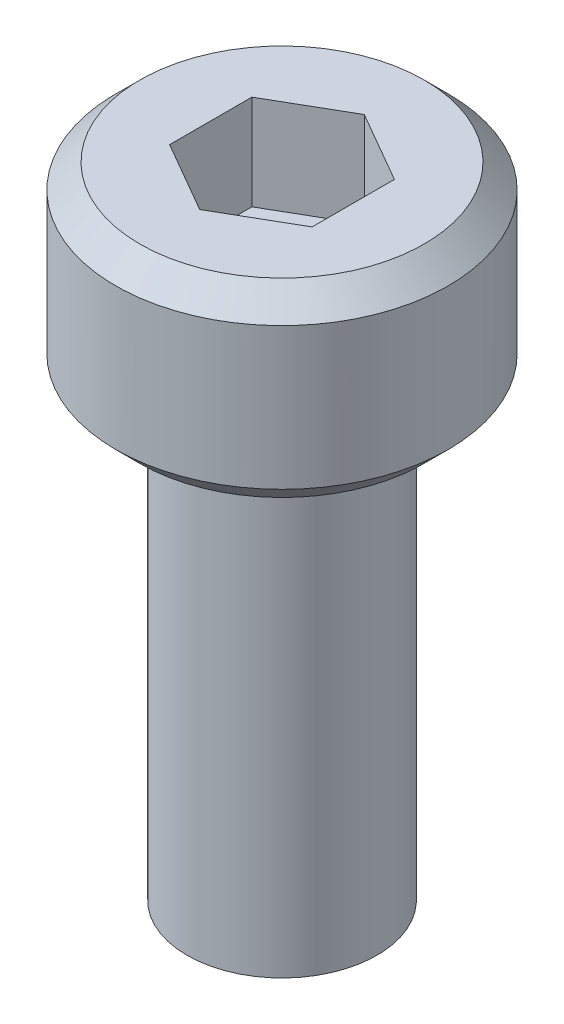
ISO-10303-21;
HEADER;
FILE_DESCRIPTION(('STEP AP214'),'2;1');
FILE_NAME('part.step','',(''),(''),'','','');
FILE_SCHEMA(('AUTOMOTIVE_DESIGN { 1 0 10303 214 1 1 1 1 }'));
ENDSEC;
DATA;
#1=APPLICATION_CONTEXT('core data for automotive mechanical design processes');
#2=APPLICATION_PROTOCOL_DEFINITION('international standard','automotive_design',2000,#1);
#3=PRODUCT_CONTEXT('',#1,'mechanical');
#4=PRODUCT('Part','Part','',(#3));
#5=PRODUCT_RELATED_PRODUCT_CATEGORY('part','',(#4));
#6=PRODUCT_DEFINITION_FORMATION('','',#4);
#7=PRODUCT_DEFINITION_CONTEXT('part definition',#1,'design');
#8=PRODUCT_DEFINITION('design','',#6,#7);
#9=PRODUCT_DEFINITION_SHAPE('','',#8);
#10=(LENGTH_UNIT() NAMED_UNIT(*) SI_UNIT(.MILLI.,.METRE.));
#11=(NAMED_UNIT(*) PLANE_ANGLE_UNIT() SI_UNIT($,.RADIAN.));
#12=(NAMED_UNIT(*) SI_UNIT($,.STERADIAN.) SOLID_ANGLE_UNIT());
#13=UNCERTAINTY_MEASURE_WITH_UNIT(LENGTH_MEASURE(1.E-05),#10,'distance_accuracy_value','');
#14=(GEOMETRIC_REPRESENTATION_CONTEXT(3) GLOBAL_UNCERTAINTY_ASSIGNED_CONTEXT((#13)) GLOBAL_UNIT_ASSIGNED_CONTEXT((#10,
#11,#12)) REPRESENTATION_CONTEXT('',''));
#15=CARTESIAN_POINT('',(0.,0.,0.));
#16=DIRECTION('',(0.,0.,1.));
#17=DIRECTION('',(1.,0.,0.));
#18=AXIS2_PLACEMENT_3D('',#15,#16,#17);
#19=CARTESIAN_POINT('',(0.,1.99999199999999,-1.73205080756887));
#20=DIRECTION('',(-0.5,0.,-0.866025403784439));
#21=DIRECTION('',(-0.866025403784439,0.,0.5));
#22=AXIS2_PLACEMENT_3D('',#19,#20,#21);
#23=PLANE('',#22);
#24=DIRECTION('',(0.,-1.,0.));
#25=VECTOR('',#24,1.);
#26=CARTESIAN_POINT('',(-1.49999999999999,1.99999199999999,-0.866025403784432));
#27=LINE('',#26,#25);
#28=CARTESIAN_POINT('',(-1.49999999999999,3.99999199999999,-0.866025403784429));
#29=VERTEX_POINT('',#28);
#30=CARTESIAN_POINT('',(-1.49999999999999,1.99999199999999,-0.866025403784429));
#31=VERTEX_POINT('',#30);
#32=EDGE_CURVE('E82',#29,#31,#27,.T.);
#33=ORIENTED_EDGE('',*,*,#32,.T.);
#34=DIRECTION('',(-0.866025403784439,0.,0.5));
#35=VECTOR('',#34,1.);
#36=CARTESIAN_POINT('',(0.,1.99999199999999,-1.73205080756887));
#37=LINE('',#36,#35);
#38=CARTESIAN_POINT('',(0.,1.999992,-1.73205080756887));
#39=VERTEX_POINT('',#38);
#40=EDGE_CURVE('E71',#39,#31,#37,.T.);
#41=ORIENTED_EDGE('',*,*,#40,.F.);
#42=DIRECTION('',(0.,1.,0.));
#43=VECTOR('',#42,1.);
#44=CARTESIAN_POINT('',(0.,1.99999200000003,-1.73205080756886));
#45=LINE('',#44,#43);
#46=CARTESIAN_POINT('',(0.,3.99999200000001,-1.73205080756887));
#47=VERTEX_POINT('',#46);
#48=EDGE_CURVE('E91',#39,#47,#45,.T.);
#49=ORIENTED_EDGE('',*,*,#48,.T.);
#50=DIRECTION('',(-0.866025403784439,0.,0.5));
#51=VECTOR('',#50,1.);
#52=CARTESIAN_POINT('',(0.,3.99999199999999,-1.73205080756887));
#53=LINE('',#52,#51);
#54=EDGE_CURVE('E66',#29,#47,#53,.F.);
#55=ORIENTED_EDGE('',*,*,#54,.F.);
#56=EDGE_LOOP('',(#33,#41,#49,#55));
#57=FACE_BOUND('',#56,.T.);
#58=ADVANCED_FACE('F16',(#57),#23,.F.);
#59=CARTESIAN_POINT('',(-1.49999999999999,1.99999199999999,-0.866025403784432));
#60=DIRECTION('',(-1.,0.,0.));
#61=DIRECTION('',(0.,-1.,0.));
#62=AXIS2_PLACEMENT_3D('',#59,#60,#61);
#63=PLANE('',#62);
#64=DIRECTION('',(0.,1.,0.));
#65=VECTOR('',#64,1.);
#66=CARTESIAN_POINT('',(-1.49999999999999,1.99999199999999,0.866025403784441));
#67=LINE('',#66,#65);
#68=CARTESIAN_POINT('',(-1.49999999999999,3.99999199999999,0.866025403784443));
#69=VERTEX_POINT('',#68);
#70=CARTESIAN_POINT('',(-1.49999999999999,1.99999199999999,0.866025403784439));
#71=VERTEX_POINT('',#70);
#72=EDGE_CURVE('E87',#69,#71,#67,.F.);
#73=ORIENTED_EDGE('',*,*,#72,.T.);
#74=DIRECTION('',(0.,0.,1.));
#75=VECTOR('',#74,1.);
#76=CARTESIAN_POINT('',(-1.49999999999999,1.99999199999999,-0.866025403784432));
#77=LINE('',#76,#75);
#78=EDGE_CURVE('E75',#31,#71,#77,.T.);
#79=ORIENTED_EDGE('',*,*,#78,.F.);
#80=ORIENTED_EDGE('',*,*,#32,.F.);
#81=DIRECTION('',(0.,0.,1.));
#82=VECTOR('',#81,1.);
#83=CARTESIAN_POINT('',(-1.49999999999999,3.99999199999999,-0.866025403784432));
#84=LINE('',#83,#82);
#85=EDGE_CURVE('E89',#69,#29,#84,.F.);
#86=ORIENTED_EDGE('',*,*,#85,.F.);
#87=EDGE_LOOP('',(#73,#79,#80,#86));
#88=FACE_BOUND('',#87,.T.);
#89=ADVANCED_FACE('F85',(#88),#63,.F.);
#90=CARTESIAN_POINT('',(1.50000000000001,1.99999200000003,-0.866025403784422));
#91=DIRECTION('',(0.5,0.,-0.866025403784439));
#92=DIRECTION('',(-0.866025403784439,0.,-0.5));
#93=AXIS2_PLACEMENT_3D('',#90,#91,#92);
#94=PLANE('',#93);
#95=ORIENTED_EDGE('',*,*,#48,.F.);
#96=DIRECTION('',(-0.866025403784436,0.,-0.500000000000005));
#97=VECTOR('',#96,1.);
#98=CARTESIAN_POINT('',(1.50000000000001,1.99999199999999,-0.866025403784422));
#99=LINE('',#98,#97);
#100=CARTESIAN_POINT('',(1.5,1.999992,-0.866025403784425));
#101=VERTEX_POINT('',#100);
#102=EDGE_CURVE('E78',#101,#39,#99,.T.);
#103=ORIENTED_EDGE('',*,*,#102,.F.);
#104=DIRECTION('',(0.,1.,0.));
#105=VECTOR('',#104,1.);
#106=CARTESIAN_POINT('',(1.5,1.99999199999999,-0.866025403784422));
#107=LINE('',#106,#105);
#108=CARTESIAN_POINT('',(1.5,3.99999200000002,-0.866025403784425));
#109=VERTEX_POINT('',#108);
#110=EDGE_CURVE('E121',#101,#109,#107,.T.);
#111=ORIENTED_EDGE('',*,*,#110,.T.);
#112=DIRECTION('',(-0.866025403784439,0.,-0.5));
#113=VECTOR('',#112,1.);
#114=CARTESIAN_POINT('',(1.50000000000001,3.99999200000005,-0.866025403784422));
#115=LINE('',#114,#113);
#116=EDGE_CURVE('E133',#47,#109,#115,.F.);
#117=ORIENTED_EDGE('',*,*,#116,.F.);
#118=EDGE_LOOP('',(#95,#103,#111,#117));
#119=FACE_BOUND('',#118,.T.);
#120=ADVANCED_FACE('F136',(#119),#94,.F.);
#121=CARTESIAN_POINT('',(-1.49999999999999,1.99999199999999,0.866025403784439));
#122=DIRECTION('',(-0.5,0.,0.866025403784439));
#123=DIRECTION('',(0.866025403784439,0.,0.5));
#124=AXIS2_PLACEMENT_3D('',#121,#122,#123);
#125=PLANE('',#124);
#126=DIRECTION('',(0.,1.,0.));
#127=VECTOR('',#126,1.);
#128=CARTESIAN_POINT('',(0.,1.99999199999999,1.73205080756887));
#129=LINE('',#128,#127);
#130=CARTESIAN_POINT('',(0.,3.99999199999999,1.73205080756888));
#131=VERTEX_POINT('',#130);
#132=CARTESIAN_POINT('',(0.,1.99999199999999,1.73205080756887));
#133=VERTEX_POINT('',#132);
#134=EDGE_CURVE('E118',#131,#133,#129,.F.);
#135=ORIENTED_EDGE('',*,*,#134,.T.);
#136=DIRECTION('',(0.86602540378444,0.,0.499999999999998));
#137=VECTOR('',#136,1.);
#138=CARTESIAN_POINT('',(-1.49999999999999,1.99999199999999,0.866025403784439));
#139=LINE('',#138,#137);
#140=EDGE_CURVE('E127',#71,#133,#139,.T.);
#141=ORIENTED_EDGE('',*,*,#140,.F.);
#142=ORIENTED_EDGE('',*,*,#72,.F.);
#143=DIRECTION('',(0.866025403784439,0.,0.5));
#144=VECTOR('',#143,1.);
#145=CARTESIAN_POINT('',(-1.49999999999999,3.99999199999999,0.866025403784439));
#146=LINE('',#145,#144);
#147=EDGE_CURVE('E129',#131,#69,#146,.F.);
#148=ORIENTED_EDGE('',*,*,#147,.F.);
#149=EDGE_LOOP('',(#135,#141,#142,#148));
#150=FACE_BOUND('',#149,.T.);
#151=ADVANCED_FACE('F143',(#150),#125,.F.);
#152=CARTESIAN_POINT('',(1.5,1.99999199999999,2.5980762113533));
#153=DIRECTION('',(0.,1.,0.));
#154=DIRECTION('',(0.,0.,1.));
#155=AXIS2_PLACEMENT_3D('',#152,#153,#154);
#156=PLANE('',#155);
#157=ORIENTED_EDGE('',*,*,#40,.T.);
#158=ORIENTED_EDGE('',*,*,#78,.T.);
#159=ORIENTED_EDGE('',*,*,#140,.T.);
#160=DIRECTION('',(0.866025403784439,0.,-0.5));
#161=VECTOR('',#160,1.);
#162=CARTESIAN_POINT('',(0.,1.99999199999999,1.73205080756887));
#163=LINE('',#162,#161);
#164=CARTESIAN_POINT('',(1.5,1.99999199999999,0.866025403784437));
#165=VERTEX_POINT('',#164);
#166=EDGE_CURVE('E116',#133,#165,#163,.T.);
#167=ORIENTED_EDGE('',*,*,#166,.T.);
#168=DIRECTION('',(0.,0.,1.));
#169=VECTOR('',#168,1.);
#170=CARTESIAN_POINT('',(1.5,1.99999199999999,0.866025403784439));
#171=LINE('',#170,#169);
#172=EDGE_CURVE('E124',#165,#101,#171,.F.);
#173=ORIENTED_EDGE('',*,*,#172,.T.);
#174=ORIENTED_EDGE('',*,*,#102,.T.);
#175=EDGE_LOOP('',(#157,#158,#159,#167,#173,#174));
#176=FACE_BOUND('',#175,.T.);
#177=ADVANCED_FACE('F72',(#176),#156,.T.);
#178=CARTESIAN_POINT('',(1.5,1.99999199999999,0.866025403784439));
#179=DIRECTION('',(1.,0.,0.));
#180=DIRECTION('',(0.,1.,0.));
#181=AXIS2_PLACEMENT_3D('',#178,#179,#180);
#182=PLANE('',#181);
#183=ORIENTED_EDGE('',*,*,#110,.F.);
#184=ORIENTED_EDGE('',*,*,#172,.F.);
#185=DIRECTION('',(0.,1.,0.));
#186=VECTOR('',#185,1.);
#187=CARTESIAN_POINT('',(1.5,1.99999199999999,0.866025403784431));
#188=LINE('',#187,#186);
#189=CARTESIAN_POINT('',(1.5,3.99999199999999,0.866025403784437));
#190=VERTEX_POINT('',#189);
#191=EDGE_CURVE('E114',#165,#190,#188,.T.);
#192=ORIENTED_EDGE('',*,*,#191,.T.);
#193=DIRECTION('',(0.,0.,1.));
#194=VECTOR('',#193,1.);
#195=CARTESIAN_POINT('',(1.5,3.99999199999999,0.866025403784439));
#196=LINE('',#195,#194);
#197=EDGE_CURVE('E34',#109,#190,#196,.T.);
#198=ORIENTED_EDGE('',*,*,#197,.F.);
#199=EDGE_LOOP('',(#183,#184,#192,#198));
#200=FACE_BOUND('',#199,.T.);
#201=ADVANCED_FACE('F150',(#200),#182,.F.);
#202=CARTESIAN_POINT('',(0.,1.99999199999999,1.73205080756887));
#203=DIRECTION('',(0.5,0.,0.866025403784439));
#204=DIRECTION('',(0.866025403784439,0.,-0.5));
#205=AXIS2_PLACEMENT_3D('',#202,#203,#204);
#206=PLANE('',#205);
#207=ORIENTED_EDGE('',*,*,#191,.F.);
#208=ORIENTED_EDGE('',*,*,#166,.F.);
#209=ORIENTED_EDGE('',*,*,#134,.F.);
#210=DIRECTION('',(-0.866025403784435,0.,0.500000000000006));
#211=VECTOR('',#210,1.);
#212=CARTESIAN_POINT('',(1.5,3.99999199999999,0.866025403784439));
#213=LINE('',#212,#211);
#214=EDGE_CURVE('E112',#190,#131,#213,.T.);
#215=ORIENTED_EDGE('',*,*,#214,.F.);
#216=EDGE_LOOP('',(#207,#208,#209,#215));
#217=FACE_BOUND('',#216,.T.);
#218=ADVANCED_FACE('F148',(#217),#206,.F.);
#219=CARTESIAN_POINT('',(0.,3.99999199999999,0.));
#220=DIRECTION('',(0.,1.,0.));
#221=DIRECTION('',(0.,0.,1.));
#222=AXIS2_PLACEMENT_3D('',#219,#220,#221);
#223=PLANE('',#222);
#224=ORIENTED_EDGE('',*,*,#197,.T.);
#225=ORIENTED_EDGE('',*,*,#214,.T.);
#226=ORIENTED_EDGE('',*,*,#147,.T.);
#227=ORIENTED_EDGE('',*,*,#85,.T.);
#228=ORIENTED_EDGE('',*,*,#54,.T.);
#229=ORIENTED_EDGE('',*,*,#116,.T.);
#230=EDGE_LOOP('',(#224,#225,#226,#227,#228,#229));
#231=FACE_BOUND('',#230,.T.);
#232=CARTESIAN_POINT('',(0.,3.99999199993317,0.));
#233=DIRECTION('',(0.,-1.,0.));
#234=DIRECTION('',(0.,0.,-1.));
#235=AXIS2_PLACEMENT_3D('',#232,#233,#234);
#236=CIRCLE('',#235,2.9920000000061);
#237=CARTESIAN_POINT('',(0.,3.99999199993317,-2.9920000000061));
#238=VERTEX_POINT('',#237);
#239=EDGE_CURVE('E19',#238,#238,#236,.T.);
#240=ORIENTED_EDGE('',*,*,#239,.F.);
#241=EDGE_LOOP('',(#240));
#242=FACE_BOUND('',#241,.T.);
#243=ADVANCED_FACE('F138',(#231,#242),#223,.T.);
#244=CARTESIAN_POINT('',(0.,3.49199200013572,0.));
#245=DIRECTION('',(0.,-1.,0.));
#246=DIRECTION('',(0.,0.,-1.));
#247=AXIS2_PLACEMENT_3D('',#244,#245,#246);
#248=CONICAL_SURFACE('',#247,3.49999999980355,0.785398163397448);
#249=ORIENTED_EDGE('',*,*,#239,.T.);
#250=EDGE_LOOP('',(#249));
#251=FACE_BOUND('',#250,.T.);
#252=CARTESIAN_POINT('',(0.,3.491992,0.));
#253=DIRECTION('',(0.,-1.,0.));
#254=DIRECTION('',(0.,0.,-1.));
#255=AXIS2_PLACEMENT_3D('',#252,#253,#254);
#256=CIRCLE('',#255,3.5);
#257=CARTESIAN_POINT('',(0.,3.491992,-3.5));
#258=VERTEX_POINT('',#257);
#259=EDGE_CURVE('E104',#258,#258,#256,.T.);
#260=ORIENTED_EDGE('',*,*,#259,.F.);
#261=EDGE_LOOP('',(#260));
#262=FACE_BOUND('',#261,.T.);
#263=ADVANCED_FACE('F187',(#251,#262),#248,.T.);
#264=CARTESIAN_POINT('',(0.,3.99999199999999,0.));
#265=DIRECTION('',(0.,-1.,0.));
#266=DIRECTION('',(0.,0.,-1.));
#267=AXIS2_PLACEMENT_3D('',#264,#265,#266);
#268=CYLINDRICAL_SURFACE('',#267,3.5);
#269=ORIENTED_EDGE('',*,*,#259,.T.);
#270=EDGE_LOOP('',(#269));
#271=FACE_BOUND('',#270,.T.);
#272=CARTESIAN_POINT('',(0.,0.507999999967979,0.));
#273=DIRECTION('',(0.,1.,0.));
#274=DIRECTION('',(0.,0.,1.));
#275=AXIS2_PLACEMENT_3D('',#272,#273,#274);
#276=CIRCLE('',#275,3.49999999997408);
#277=CARTESIAN_POINT('',(0.,0.507999999967979,3.49999999997408));
#278=VERTEX_POINT('',#277);
#279=EDGE_CURVE('E100',#278,#278,#276,.F.);
#280=ORIENTED_EDGE('',*,*,#279,.F.);
#281=EDGE_LOOP('',(#280));
#282=FACE_BOUND('',#281,.T.);
#283=ADVANCED_FACE('F183',(#271,#282),#268,.T.);
#284=CARTESIAN_POINT('',(0.,-10.,0.));
#285=DIRECTION('',(0.,1.,0.));
#286=DIRECTION('',(0.,0.,1.));
#287=AXIS2_PLACEMENT_3D('',#284,#285,#286);
#288=PLANE('',#287);
#289=CARTESIAN_POINT('',(0.,-10.000000000008,0.));
#290=DIRECTION('',(0.,1.,0.));
#291=DIRECTION('',(0.,0.,1.));
#292=AXIS2_PLACEMENT_3D('',#289,#290,#291);
#293=CIRCLE('',#292,1.23037999998133);
#294=CARTESIAN_POINT('',(0.,-10.000000000008,1.23037999998132));
#295=VERTEX_POINT('',#294);
#296=EDGE_CURVE('E98',#295,#295,#293,.T.);
#297=ORIENTED_EDGE('',*,*,#296,.F.);
#298=EDGE_LOOP('',(#297));
#299=FACE_BOUND('',#298,.T.);
#300=ADVANCED_FACE('F179',(#299),#288,.F.);
#301=CARTESIAN_POINT('',(0.,0.508000000024822,0.));
#302=DIRECTION('',(0.,1.,0.));
#303=DIRECTION('',(0.,0.,1.));
#304=AXIS2_PLACEMENT_3D('',#301,#302,#303);
#305=CONICAL_SURFACE('',#304,3.50000000008777,0.785398163453397);
#306=CARTESIAN_POINT('',(0.,0.,0.));
#307=DIRECTION('',(0.,1.,0.));
#308=DIRECTION('',(0.,0.,1.));
#309=AXIS2_PLACEMENT_3D('',#306,#307,#308);
#310=CIRCLE('',#309,2.9920000000061);
#311=CARTESIAN_POINT('',(0.,0.,2.9920000000061));
#312=VERTEX_POINT('',#311);
#313=EDGE_CURVE('E96',#312,#312,#310,.T.);
#314=ORIENTED_EDGE('',*,*,#313,.T.);
#315=EDGE_LOOP('',(#314));
#316=FACE_BOUND('',#315,.T.);
#317=ORIENTED_EDGE('',*,*,#279,.T.);
#318=EDGE_LOOP('',(#317));
#319=FACE_BOUND('',#318,.T.);
#320=ADVANCED_FACE('F175',(#316,#319),#305,.T.);
#321=CARTESIAN_POINT('',(0.,-9.46152000000211,0.));
#322=DIRECTION('',(0.,1.,0.));
#323=DIRECTION('',(0.,0.,1.));
#324=AXIS2_PLACEMENT_3D('',#321,#322,#323);
#325=CONICAL_SURFACE('',#324,1.99999999989587,0.960291895353206);
#326=CARTESIAN_POINT('',(0.,-9.46152,0.));
#327=DIRECTION('',(0.,1.,0.));
#328=DIRECTION('',(0.,0.,1.));
#329=AXIS2_PLACEMENT_3D('',#326,#327,#328);
#330=CIRCLE('',#329,2.);
#331=CARTESIAN_POINT('',(0.,-9.46152,1.99999999999999));
#332=VERTEX_POINT('',#331);
#333=EDGE_CURVE('E25',#332,#332,#330,.T.);
#334=ORIENTED_EDGE('',*,*,#333,.F.);
#335=EDGE_LOOP('',(#334));
#336=FACE_BOUND('',#335,.T.);
#337=ORIENTED_EDGE('',*,*,#296,.T.);
#338=EDGE_LOOP('',(#337));
#339=FACE_BOUND('',#338,.T.);
#340=ADVANCED_FACE('F168',(#336,#339),#325,.T.);
#341=CARTESIAN_POINT('',(0.,0.,0.));
#342=DIRECTION('',(0.,1.,0.));
#343=DIRECTION('',(0.,0.,1.));
#344=AXIS2_PLACEMENT_3D('',#341,#342,#343);
#345=PLANE('',#344);
#346=CARTESIAN_POINT('',(0.,0.,0.));
#347=DIRECTION('',(0.,1.,0.));
#348=DIRECTION('',(0.,0.,1.));
#349=AXIS2_PLACEMENT_3D('',#346,#347,#348);
#350=CIRCLE('',#349,2.);
#351=CARTESIAN_POINT('',(0.,0.,1.99999999999999));
#352=VERTEX_POINT('',#351);
#353=EDGE_CURVE('E11',#352,#352,#350,.F.);
#354=ORIENTED_EDGE('',*,*,#353,.F.);
#355=EDGE_LOOP('',(#354));
#356=FACE_BOUND('',#355,.T.);
#357=ORIENTED_EDGE('',*,*,#313,.F.);
#358=EDGE_LOOP('',(#357));
#359=FACE_BOUND('',#358,.T.);
#360=ADVANCED_FACE('F162',(#356,#359),#345,.F.);
#361=CARTESIAN_POINT('',(0.,-10.,0.));
#362=DIRECTION('',(0.,1.,0.));
#363=DIRECTION('',(0.,0.,1.));
#364=AXIS2_PLACEMENT_3D('',#361,#362,#363);
#365=CYLINDRICAL_SURFACE('',#364,2.);
#366=ORIENTED_EDGE('',*,*,#353,.T.);
#367=EDGE_LOOP('',(#366));
#368=FACE_BOUND('',#367,.T.);
#369=ORIENTED_EDGE('',*,*,#333,.T.);
#370=EDGE_LOOP('',(#369));
#371=FACE_BOUND('',#370,.T.);
#372=ADVANCED_FACE('F160',(#368,#371),#365,.T.);
#373=CLOSED_SHELL('',(#58,#89,#120,#151,#177,#201,#218,#243,#263,#283,#300,#320,#340,#360,#372));
#374=MANIFOLD_SOLID_BREP('B1',#373);
#375=ADVANCED_BREP_SHAPE_REPRESENTATION('',(#18,#374),#14);
#376=SHAPE_DEFINITION_REPRESENTATION(#9,#375);
ENDSEC;
END-ISO-10303-21;
